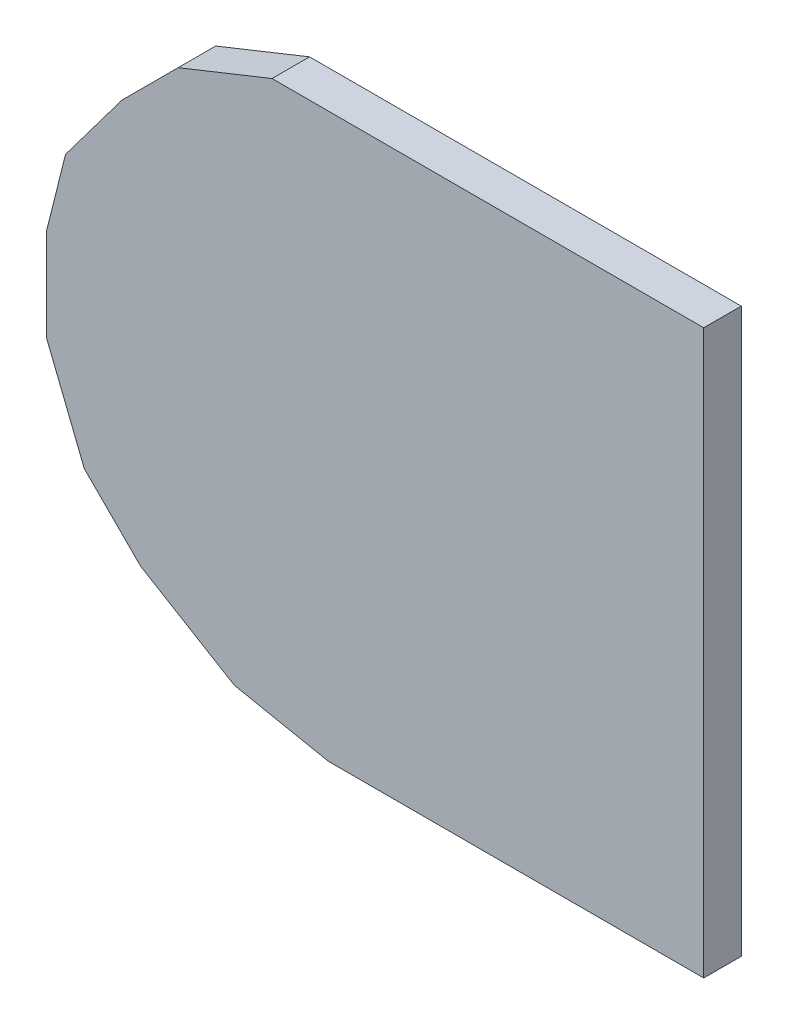
ISO-10303-21;
HEADER;
FILE_DESCRIPTION(('STEP AP214'),'2;1');
FILE_NAME('part.step','',(''),(''),'','','');
FILE_SCHEMA(('AUTOMOTIVE_DESIGN { 1 0 10303 214 1 1 1 1 }'));
ENDSEC;
DATA;
#1=APPLICATION_CONTEXT('core data for automotive mechanical design processes');
#2=APPLICATION_PROTOCOL_DEFINITION('international standard','automotive_design',2000,#1);
#3=PRODUCT_CONTEXT('',#1,'mechanical');
#4=PRODUCT('Part','Part','',(#3));
#5=PRODUCT_RELATED_PRODUCT_CATEGORY('part','',(#4));
#6=PRODUCT_DEFINITION_FORMATION('','',#4);
#7=PRODUCT_DEFINITION_CONTEXT('part definition',#1,'design');
#8=PRODUCT_DEFINITION('design','',#6,#7);
#9=PRODUCT_DEFINITION_SHAPE('','',#8);
#10=(LENGTH_UNIT() NAMED_UNIT(*) SI_UNIT(.MILLI.,.METRE.));
#11=(NAMED_UNIT(*) PLANE_ANGLE_UNIT() SI_UNIT($,.RADIAN.));
#12=(NAMED_UNIT(*) SI_UNIT($,.STERADIAN.) SOLID_ANGLE_UNIT());
#13=UNCERTAINTY_MEASURE_WITH_UNIT(LENGTH_MEASURE(1.E-05),#10,'distance_accuracy_value','');
#14=(GEOMETRIC_REPRESENTATION_CONTEXT(3) GLOBAL_UNCERTAINTY_ASSIGNED_CONTEXT((#13)) GLOBAL_UNIT_ASSIGNED_CONTEXT((#10,
#11,#12)) REPRESENTATION_CONTEXT('',''));
#15=CARTESIAN_POINT('',(0.,0.,0.));
#16=DIRECTION('',(0.,0.,1.));
#17=DIRECTION('',(1.,0.,0.));
#18=AXIS2_PLACEMENT_3D('',#15,#16,#17);
#19=CARTESIAN_POINT('',(0.17500092,-0.1499997,0.02));
#20=DIRECTION('',(0.,0.,1.));
#21=DIRECTION('',(1.,0.,0.));
#22=AXIS2_PLACEMENT_3D('',#19,#20,#21);
#23=PLANE('',#22);
#24=DIRECTION('',(0.98059025415274,-0.196068236745948,0.));
#25=VECTOR('',#24,1.);
#26=CARTESIAN_POINT('',(-0.02499868,-0.1499997,0.02));
#27=LINE('',#26,#25);
#28=CARTESIAN_POINT('',(-0.0249986800000003,-0.1499997,0.02));
#29=VERTEX_POINT('',#28);
#30=CARTESIAN_POINT('',(-0.0749985800000001,-0.140002260000001,0.02));
#31=VERTEX_POINT('',#30);
#32=EDGE_CURVE('E157',#29,#31,#27,.F.);
#33=ORIENTED_EDGE('',*,*,#32,.F.);
#34=DIRECTION('',(1.,0.,0.));
#35=VECTOR('',#34,1.);
#36=CARTESIAN_POINT('',(0.17500092,-0.1499997,0.02));
#37=LINE('',#36,#35);
#38=CARTESIAN_POINT('',(0.17500092,-0.1499997,0.02));
#39=VERTEX_POINT('',#38);
#40=EDGE_CURVE('E118',#39,#29,#37,.F.);
#41=ORIENTED_EDGE('',*,*,#40,.F.);
#42=DIRECTION('',(0.,1.,0.));
#43=VECTOR('',#42,1.);
#44=CARTESIAN_POINT('',(0.17500092,0.1499997,0.02));
#45=LINE('',#44,#43);
#46=CARTESIAN_POINT('',(0.17500092,0.1499997,0.02));
#47=VERTEX_POINT('',#46);
#48=EDGE_CURVE('E20',#47,#39,#45,.F.);
#49=ORIENTED_EDGE('',*,*,#48,.F.);
#50=DIRECTION('',(1.,0.,0.));
#51=VECTOR('',#50,1.);
#52=CARTESIAN_POINT('',(-0.05499861999999,0.1499997,0.02));
#53=LINE('',#52,#51);
#54=CARTESIAN_POINT('',(-0.0549986199999903,0.149999700000001,0.02));
#55=VERTEX_POINT('',#54);
#56=EDGE_CURVE('E107',#55,#47,#53,.T.);
#57=ORIENTED_EDGE('',*,*,#56,.F.);
#58=DIRECTION('',(-0.928476690885259,-0.371390676354104,0.));
#59=VECTOR('',#58,1.);
#60=CARTESIAN_POINT('',(-0.10499852,0.12999974,0.02));
#61=LINE('',#60,#59);
#62=CARTESIAN_POINT('',(-0.104998520000004,0.129999740000004,0.02));
#63=VERTEX_POINT('',#62);
#64=EDGE_CURVE('E102',#63,#55,#61,.F.);
#65=ORIENTED_EDGE('',*,*,#64,.F.);
#66=DIRECTION('',(-0.707106781186048,-0.707106781187048,0.));
#67=VECTOR('',#66,1.);
#68=CARTESIAN_POINT('',(-0.13499846,0.09999979999999,0.02));
#69=LINE('',#68,#67);
#70=CARTESIAN_POINT('',(-0.13499846,0.09999979999999,0.02));
#71=VERTEX_POINT('',#70);
#72=EDGE_CURVE('E129',#71,#63,#69,.F.);
#73=ORIENTED_EDGE('',*,*,#72,.F.);
#74=DIRECTION('',(-0.6,-0.8,0.));
#75=VECTOR('',#74,1.);
#76=CARTESIAN_POINT('',(-0.1649984,0.05999987999999,0.02));
#77=LINE('',#76,#75);
#78=CARTESIAN_POINT('',(-0.164998400000002,0.0599998799999906,0.02));
#79=VERTEX_POINT('',#78);
#80=EDGE_CURVE('E133',#79,#71,#77,.F.);
#81=ORIENTED_EDGE('',*,*,#80,.F.);
#82=DIRECTION('',(-0.242535625036098,-0.970142500145391,0.));
#83=VECTOR('',#82,1.);
#84=CARTESIAN_POINT('',(-0.17499838,0.01999995999999,0.02));
#85=LINE('',#84,#83);
#86=CARTESIAN_POINT('',(-0.17499838,0.01999995999999,0.02));
#87=VERTEX_POINT('',#86);
#88=EDGE_CURVE('E137',#87,#79,#85,.F.);
#89=ORIENTED_EDGE('',*,*,#88,.F.);
#90=DIRECTION('',(0.,1.,0.));
#91=VECTOR('',#90,1.);
#92=CARTESIAN_POINT('',(-0.17499838,-0.02999994,0.02));
#93=LINE('',#92,#91);
#94=CARTESIAN_POINT('',(-0.17499838,-0.02999994,0.02));
#95=VERTEX_POINT('',#94);
#96=EDGE_CURVE('E141',#95,#87,#93,.T.);
#97=ORIENTED_EDGE('',*,*,#96,.F.);
#98=DIRECTION('',(0.371390676354104,-0.928476690885259,0.));
#99=VECTOR('',#98,1.);
#100=CARTESIAN_POINT('',(-0.15499842,-0.07999984,0.02));
#101=LINE('',#100,#99);
#102=CARTESIAN_POINT('',(-0.154998420000005,-0.0799998400000053,0.02));
#103=VERTEX_POINT('',#102);
#104=EDGE_CURVE('E145',#103,#95,#101,.F.);
#105=ORIENTED_EDGE('',*,*,#104,.F.);
#106=DIRECTION('',(0.707106781187048,-0.707106781186048,0.));
#107=VECTOR('',#106,1.);
#108=CARTESIAN_POINT('',(-0.12499848,-0.10999978,0.02));
#109=LINE('',#108,#107);
#110=CARTESIAN_POINT('',(-0.124998479999998,-0.109999779999996,0.02));
#111=VERTEX_POINT('',#110);
#112=EDGE_CURVE('E149',#111,#103,#109,.F.);
#113=ORIENTED_EDGE('',*,*,#112,.F.);
#114=DIRECTION('',(0.857473707576805,-0.514527784297883,0.));
#115=VECTOR('',#114,1.);
#116=CARTESIAN_POINT('',(-0.07499858,-0.14000226,0.02));
#117=LINE('',#116,#115);
#118=EDGE_CURVE('E153',#31,#111,#117,.F.);
#119=ORIENTED_EDGE('',*,*,#118,.F.);
#120=EDGE_LOOP('',(#33,#41,#49,#57,#65,#73,#81,#89,#97,#105,#113,#119));
#121=FACE_BOUND('',#120,.T.);
#122=ADVANCED_FACE('F17',(#121),#23,.T.);
#123=CARTESIAN_POINT('',(0.17500092,0.1499997,0.));
#124=DIRECTION('',(1.,0.,0.));
#125=DIRECTION('',(0.,0.,-1.));
#126=AXIS2_PLACEMENT_3D('',#123,#124,#125);
#127=PLANE('',#126);
#128=DIRECTION('',(0.,0.,-1.));
#129=VECTOR('',#128,1.);
#130=CARTESIAN_POINT('',(0.17500092,-0.1499997,0.));
#131=LINE('',#130,#129);
#132=CARTESIAN_POINT('',(0.17500092,-0.1499997,0.));
#133=VERTEX_POINT('',#132);
#134=EDGE_CURVE('E161',#133,#39,#131,.F.);
#135=ORIENTED_EDGE('',*,*,#134,.F.);
#136=DIRECTION('',(0.,1.,0.));
#137=VECTOR('',#136,1.);
#138=CARTESIAN_POINT('',(0.17500092,-0.1499997,0.));
#139=LINE('',#138,#137);
#140=CARTESIAN_POINT('',(0.17500092,0.1499997,0.));
#141=VERTEX_POINT('',#140);
#142=EDGE_CURVE('E124',#133,#141,#139,.T.);
#143=ORIENTED_EDGE('',*,*,#142,.T.);
#144=DIRECTION('',(0.,0.,1.));
#145=VECTOR('',#144,1.);
#146=CARTESIAN_POINT('',(0.17500092,0.1499997,0.));
#147=LINE('',#146,#145);
#148=EDGE_CURVE('E112',#47,#141,#147,.F.);
#149=ORIENTED_EDGE('',*,*,#148,.F.);
#150=ORIENTED_EDGE('',*,*,#48,.T.);
#151=EDGE_LOOP('',(#135,#143,#149,#150));
#152=FACE_BOUND('',#151,.T.);
#153=ADVANCED_FACE('F123',(#152),#127,.T.);
#154=CARTESIAN_POINT('',(-0.05499861999999,0.1499997,0.));
#155=DIRECTION('',(0.,1.,0.));
#156=DIRECTION('',(0.,0.,1.));
#157=AXIS2_PLACEMENT_3D('',#154,#155,#156);
#158=PLANE('',#157);
#159=ORIENTED_EDGE('',*,*,#148,.T.);
#160=DIRECTION('',(1.,0.,0.));
#161=VECTOR('',#160,1.);
#162=CARTESIAN_POINT('',(0.17500092,0.1499997,0.));
#163=LINE('',#162,#161);
#164=CARTESIAN_POINT('',(-0.0549986199999903,0.149999700000001,0.));
#165=VERTEX_POINT('',#164);
#166=EDGE_CURVE('E166',#141,#165,#163,.F.);
#167=ORIENTED_EDGE('',*,*,#166,.T.);
#168=DIRECTION('',(0.,0.,1.));
#169=VECTOR('',#168,1.);
#170=CARTESIAN_POINT('',(-0.0549986199999914,0.149999700000003,0.));
#171=LINE('',#170,#169);
#172=EDGE_CURVE('E114',#55,#165,#171,.F.);
#173=ORIENTED_EDGE('',*,*,#172,.F.);
#174=ORIENTED_EDGE('',*,*,#56,.T.);
#175=EDGE_LOOP('',(#159,#167,#173,#174));
#176=FACE_BOUND('',#175,.T.);
#177=ADVANCED_FACE('F109',(#176),#158,.T.);
#178=CARTESIAN_POINT('',(-0.10499852,0.12999974,0.));
#179=DIRECTION('',(-0.371390676354104,0.928476690885259,0.));
#180=DIRECTION('',(-0.928476690885259,-0.371390676354104,0.));
#181=AXIS2_PLACEMENT_3D('',#178,#179,#180);
#182=PLANE('',#181);
#183=ORIENTED_EDGE('',*,*,#172,.T.);
#184=DIRECTION('',(-0.928476690885285,-0.37139067635404,0.));
#185=VECTOR('',#184,1.);
#186=CARTESIAN_POINT('',(-0.05499861999999,0.1499997,0.));
#187=LINE('',#186,#185);
#188=CARTESIAN_POINT('',(-0.104998520000004,0.129999740000004,0.));
#189=VERTEX_POINT('',#188);
#190=EDGE_CURVE('E168',#165,#189,#187,.T.);
#191=ORIENTED_EDGE('',*,*,#190,.T.);
#192=DIRECTION('',(0.,0.,1.));
#193=VECTOR('',#192,1.);
#194=CARTESIAN_POINT('',(-0.104998520000016,0.129999740000016,0.));
#195=LINE('',#194,#193);
#196=EDGE_CURVE('E131',#63,#189,#195,.F.);
#197=ORIENTED_EDGE('',*,*,#196,.F.);
#198=ORIENTED_EDGE('',*,*,#64,.T.);
#199=EDGE_LOOP('',(#183,#191,#197,#198));
#200=FACE_BOUND('',#199,.T.);
#201=ADVANCED_FACE('F234',(#200),#182,.T.);
#202=CARTESIAN_POINT('',(-0.13499846,0.09999979999999,0.));
#203=DIRECTION('',(-0.707106781187048,0.707106781186048,0.));
#204=DIRECTION('',(-0.707106781186048,-0.707106781187048,0.));
#205=AXIS2_PLACEMENT_3D('',#202,#203,#204);
#206=PLANE('',#205);
#207=ORIENTED_EDGE('',*,*,#196,.T.);
#208=DIRECTION('',(-0.70710678118643,-0.707106781186665,0.));
#209=VECTOR('',#208,1.);
#210=CARTESIAN_POINT('',(-0.10499852,0.12999974,0.));
#211=LINE('',#210,#209);
#212=CARTESIAN_POINT('',(-0.13499846,0.09999979999999,0.));
#213=VERTEX_POINT('',#212);
#214=EDGE_CURVE('E171',#189,#213,#211,.T.);
#215=ORIENTED_EDGE('',*,*,#214,.T.);
#216=DIRECTION('',(0.,0.,1.));
#217=VECTOR('',#216,1.);
#218=CARTESIAN_POINT('',(-0.13499846,0.09999979999999,0.));
#219=LINE('',#218,#217);
#220=EDGE_CURVE('E135',#71,#213,#219,.F.);
#221=ORIENTED_EDGE('',*,*,#220,.F.);
#222=ORIENTED_EDGE('',*,*,#72,.T.);
#223=EDGE_LOOP('',(#207,#215,#221,#222));
#224=FACE_BOUND('',#223,.T.);
#225=ADVANCED_FACE('F233',(#224),#206,.T.);
#226=CARTESIAN_POINT('',(-0.1649984,0.05999987999999,0.));
#227=DIRECTION('',(-0.8,0.6,0.));
#228=DIRECTION('',(-0.6,-0.8,0.));
#229=AXIS2_PLACEMENT_3D('',#226,#227,#228);
#230=PLANE('',#229);
#231=ORIENTED_EDGE('',*,*,#220,.T.);
#232=DIRECTION('',(-0.6,-0.8,0.));
#233=VECTOR('',#232,1.);
#234=CARTESIAN_POINT('',(-0.13499846,0.09999979999999,0.));
#235=LINE('',#234,#233);
#236=CARTESIAN_POINT('',(-0.164998400000002,0.0599998799999906,0.));
#237=VERTEX_POINT('',#236);
#238=EDGE_CURVE('E174',#213,#237,#235,.T.);
#239=ORIENTED_EDGE('',*,*,#238,.T.);
#240=DIRECTION('',(0.,0.,1.));
#241=VECTOR('',#240,1.);
#242=CARTESIAN_POINT('',(-0.16499840000001,0.0599998799999924,0.));
#243=LINE('',#242,#241);
#244=EDGE_CURVE('E139',#79,#237,#243,.F.);
#245=ORIENTED_EDGE('',*,*,#244,.F.);
#246=ORIENTED_EDGE('',*,*,#80,.T.);
#247=EDGE_LOOP('',(#231,#239,#245,#246));
#248=FACE_BOUND('',#247,.T.);
#249=ADVANCED_FACE('F227',(#248),#230,.T.);
#250=CARTESIAN_POINT('',(-0.17499838,0.01999995999999,0.));
#251=DIRECTION('',(-0.970142500145391,0.242535625036098,0.));
#252=DIRECTION('',(-0.242535625036098,-0.970142500145391,0.));
#253=AXIS2_PLACEMENT_3D('',#250,#251,#252);
#254=PLANE('',#253);
#255=ORIENTED_EDGE('',*,*,#244,.T.);
#256=DIRECTION('',(-0.242535625036333,-0.970142500145332,0.));
#257=VECTOR('',#256,1.);
#258=CARTESIAN_POINT('',(-0.1649984,0.05999987999999,0.));
#259=LINE('',#258,#257);
#260=CARTESIAN_POINT('',(-0.17499838,0.01999995999999,0.));
#261=VERTEX_POINT('',#260);
#262=EDGE_CURVE('E177',#237,#261,#259,.T.);
#263=ORIENTED_EDGE('',*,*,#262,.T.);
#264=DIRECTION('',(0.,0.,1.));
#265=VECTOR('',#264,1.);
#266=CARTESIAN_POINT('',(-0.17499838,0.01999995999999,0.));
#267=LINE('',#266,#265);
#268=EDGE_CURVE('E143',#87,#261,#267,.F.);
#269=ORIENTED_EDGE('',*,*,#268,.F.);
#270=ORIENTED_EDGE('',*,*,#88,.T.);
#271=EDGE_LOOP('',(#255,#263,#269,#270));
#272=FACE_BOUND('',#271,.T.);
#273=ADVANCED_FACE('F223',(#272),#254,.T.);
#274=CARTESIAN_POINT('',(-0.17499838,-0.02999994,0.));
#275=DIRECTION('',(-1.,0.,0.));
#276=DIRECTION('',(0.,0.,1.));
#277=AXIS2_PLACEMENT_3D('',#274,#275,#276);
#278=PLANE('',#277);
#279=ORIENTED_EDGE('',*,*,#268,.T.);
#280=DIRECTION('',(0.,1.,0.));
#281=VECTOR('',#280,1.);
#282=CARTESIAN_POINT('',(-0.17499838,-0.1499997,0.));
#283=LINE('',#282,#281);
#284=CARTESIAN_POINT('',(-0.17499838,-0.02999994,0.));
#285=VERTEX_POINT('',#284);
#286=EDGE_CURVE('E180',#261,#285,#283,.F.);
#287=ORIENTED_EDGE('',*,*,#286,.T.);
#288=DIRECTION('',(0.,0.,1.));
#289=VECTOR('',#288,1.);
#290=CARTESIAN_POINT('',(-0.17499838,-0.02999994,0.));
#291=LINE('',#290,#289);
#292=EDGE_CURVE('E147',#95,#285,#291,.F.);
#293=ORIENTED_EDGE('',*,*,#292,.F.);
#294=ORIENTED_EDGE('',*,*,#96,.T.);
#295=EDGE_LOOP('',(#279,#287,#293,#294));
#296=FACE_BOUND('',#295,.T.);
#297=ADVANCED_FACE('F217',(#296),#278,.T.);
#298=CARTESIAN_POINT('',(-0.15499842,-0.07999984,0.));
#299=DIRECTION('',(-0.928476690885259,-0.371390676354104,0.));
#300=DIRECTION('',(0.371390676354104,-0.928476690885259,0.));
#301=AXIS2_PLACEMENT_3D('',#298,#299,#300);
#302=PLANE('',#301);
#303=ORIENTED_EDGE('',*,*,#292,.T.);
#304=DIRECTION('',(0.371390676354104,-0.928476690885259,0.));
#305=VECTOR('',#304,1.);
#306=CARTESIAN_POINT('',(-0.17499838,-0.02999994,0.));
#307=LINE('',#306,#305);
#308=CARTESIAN_POINT('',(-0.154998420000005,-0.0799998400000053,0.));
#309=VERTEX_POINT('',#308);
#310=EDGE_CURVE('E183',#285,#309,#307,.T.);
#311=ORIENTED_EDGE('',*,*,#310,.T.);
#312=DIRECTION('',(0.,0.,1.));
#313=VECTOR('',#312,1.);
#314=CARTESIAN_POINT('',(-0.154998420000021,-0.0799998400000212,0.));
#315=LINE('',#314,#313);
#316=EDGE_CURVE('E151',#103,#309,#315,.F.);
#317=ORIENTED_EDGE('',*,*,#316,.F.);
#318=ORIENTED_EDGE('',*,*,#104,.T.);
#319=EDGE_LOOP('',(#303,#311,#317,#318));
#320=FACE_BOUND('',#319,.T.);
#321=ADVANCED_FACE('F213',(#320),#302,.T.);
#322=CARTESIAN_POINT('',(-0.12499848,-0.10999978,0.));
#323=DIRECTION('',(-0.707106781186048,-0.707106781187048,0.));
#324=DIRECTION('',(0.707106781187048,-0.707106781186048,0.));
#325=AXIS2_PLACEMENT_3D('',#322,#323,#324);
#326=PLANE('',#325);
#327=ORIENTED_EDGE('',*,*,#316,.T.);
#328=DIRECTION('',(0.707106781186547,-0.707106781186547,0.));
#329=VECTOR('',#328,1.);
#330=CARTESIAN_POINT('',(-0.15499842,-0.07999984,0.));
#331=LINE('',#330,#329);
#332=CARTESIAN_POINT('',(-0.124998479999998,-0.109999779999996,0.));
#333=VERTEX_POINT('',#332);
#334=EDGE_CURVE('E186',#309,#333,#331,.T.);
#335=ORIENTED_EDGE('',*,*,#334,.T.);
#336=DIRECTION('',(0.,0.,1.));
#337=VECTOR('',#336,1.);
#338=CARTESIAN_POINT('',(-0.124998479999991,-0.109999779999986,0.));
#339=LINE('',#338,#337);
#340=EDGE_CURVE('E155',#111,#333,#339,.F.);
#341=ORIENTED_EDGE('',*,*,#340,.F.);
#342=ORIENTED_EDGE('',*,*,#112,.T.);
#343=EDGE_LOOP('',(#327,#335,#341,#342));
#344=FACE_BOUND('',#343,.T.);
#345=ADVANCED_FACE('F207',(#344),#326,.T.);
#346=CARTESIAN_POINT('',(-0.07499858,-0.14000226,0.));
#347=DIRECTION('',(-0.514527784297883,-0.857473707576805,0.));
#348=DIRECTION('',(0.857473707576805,-0.514527784297883,0.));
#349=AXIS2_PLACEMENT_3D('',#346,#347,#348);
#350=PLANE('',#349);
#351=ORIENTED_EDGE('',*,*,#340,.T.);
#352=DIRECTION('',(0.857473707576953,-0.514527784297635,0.));
#353=VECTOR('',#352,1.);
#354=CARTESIAN_POINT('',(-0.12499848,-0.10999978,0.));
#355=LINE('',#354,#353);
#356=CARTESIAN_POINT('',(-0.0749985800000001,-0.140002260000001,0.));
#357=VERTEX_POINT('',#356);
#358=EDGE_CURVE('E189',#333,#357,#355,.T.);
#359=ORIENTED_EDGE('',*,*,#358,.T.);
#360=DIRECTION('',(0.,0.,1.));
#361=VECTOR('',#360,1.);
#362=CARTESIAN_POINT('',(-0.0749985800000006,-0.140002260000003,0.));
#363=LINE('',#362,#361);
#364=EDGE_CURVE('E159',#31,#357,#363,.F.);
#365=ORIENTED_EDGE('',*,*,#364,.F.);
#366=ORIENTED_EDGE('',*,*,#118,.T.);
#367=EDGE_LOOP('',(#351,#359,#365,#366));
#368=FACE_BOUND('',#367,.T.);
#369=ADVANCED_FACE('F202',(#368),#350,.T.);
#370=CARTESIAN_POINT('',(-0.02499868,-0.1499997,0.));
#371=DIRECTION('',(-0.196068236745948,-0.98059025415274,0.));
#372=DIRECTION('',(0.98059025415274,-0.196068236745948,0.));
#373=AXIS2_PLACEMENT_3D('',#370,#371,#372);
#374=PLANE('',#373);
#375=ORIENTED_EDGE('',*,*,#364,.T.);
#376=DIRECTION('',(0.980590254152728,-0.196068236746007,0.));
#377=VECTOR('',#376,1.);
#378=CARTESIAN_POINT('',(-0.07499858,-0.14000226,0.));
#379=LINE('',#378,#377);
#380=CARTESIAN_POINT('',(-0.0249986800000001,-0.1499997,0.));
#381=VERTEX_POINT('',#380);
#382=EDGE_CURVE('E26',#357,#381,#379,.T.);
#383=ORIENTED_EDGE('',*,*,#382,.T.);
#384=DIRECTION('',(0.,0.,-1.));
#385=VECTOR('',#384,1.);
#386=CARTESIAN_POINT('',(-0.02499868,-0.1499997,0.));
#387=LINE('',#386,#385);
#388=EDGE_CURVE('E34',#29,#381,#387,.T.);
#389=ORIENTED_EDGE('',*,*,#388,.F.);
#390=ORIENTED_EDGE('',*,*,#32,.T.);
#391=EDGE_LOOP('',(#375,#383,#389,#390));
#392=FACE_BOUND('',#391,.T.);
#393=ADVANCED_FACE('F195',(#392),#374,.T.);
#394=CARTESIAN_POINT('',(0.17500092,-0.1499997,0.));
#395=DIRECTION('',(0.,-1.,0.));
#396=DIRECTION('',(0.,0.,-1.));
#397=AXIS2_PLACEMENT_3D('',#394,#395,#396);
#398=PLANE('',#397);
#399=ORIENTED_EDGE('',*,*,#388,.T.);
#400=DIRECTION('',(1.,0.,0.));
#401=VECTOR('',#400,1.);
#402=CARTESIAN_POINT('',(0.17500092,-0.1499997,0.));
#403=LINE('',#402,#401);
#404=EDGE_CURVE('E11',#381,#133,#403,.T.);
#405=ORIENTED_EDGE('',*,*,#404,.T.);
#406=ORIENTED_EDGE('',*,*,#134,.T.);
#407=ORIENTED_EDGE('',*,*,#40,.T.);
#408=EDGE_LOOP('',(#399,#405,#406,#407));
#409=FACE_BOUND('',#408,.T.);
#410=ADVANCED_FACE('F235',(#409),#398,.T.);
#411=CARTESIAN_POINT('',(0.17500092,-0.1499997,0.));
#412=DIRECTION('',(0.,0.,1.));
#413=DIRECTION('',(1.,0.,0.));
#414=AXIS2_PLACEMENT_3D('',#411,#412,#413);
#415=PLANE('',#414);
#416=ORIENTED_EDGE('',*,*,#382,.F.);
#417=ORIENTED_EDGE('',*,*,#358,.F.);
#418=ORIENTED_EDGE('',*,*,#334,.F.);
#419=ORIENTED_EDGE('',*,*,#310,.F.);
#420=ORIENTED_EDGE('',*,*,#286,.F.);
#421=ORIENTED_EDGE('',*,*,#262,.F.);
#422=ORIENTED_EDGE('',*,*,#238,.F.);
#423=ORIENTED_EDGE('',*,*,#214,.F.);
#424=ORIENTED_EDGE('',*,*,#190,.F.);
#425=ORIENTED_EDGE('',*,*,#166,.F.);
#426=ORIENTED_EDGE('',*,*,#142,.F.);
#427=ORIENTED_EDGE('',*,*,#404,.F.);
#428=EDGE_LOOP('',(#416,#417,#418,#419,#420,#421,#422,#423,#424,#425,#426,#427));
#429=FACE_BOUND('',#428,.T.);
#430=ADVANCED_FACE('F199',(#429),#415,.F.);
#431=CLOSED_SHELL('',(#122,#153,#177,#201,#225,#249,#273,#297,#321,#345,#369,#393,#410,#430));
#432=MANIFOLD_SOLID_BREP('B1',#431);
#433=ADVANCED_BREP_SHAPE_REPRESENTATION('',(#18,#432),#14);
#434=SHAPE_DEFINITION_REPRESENTATION(#9,#433);
ENDSEC;
END-ISO-10303-21;
